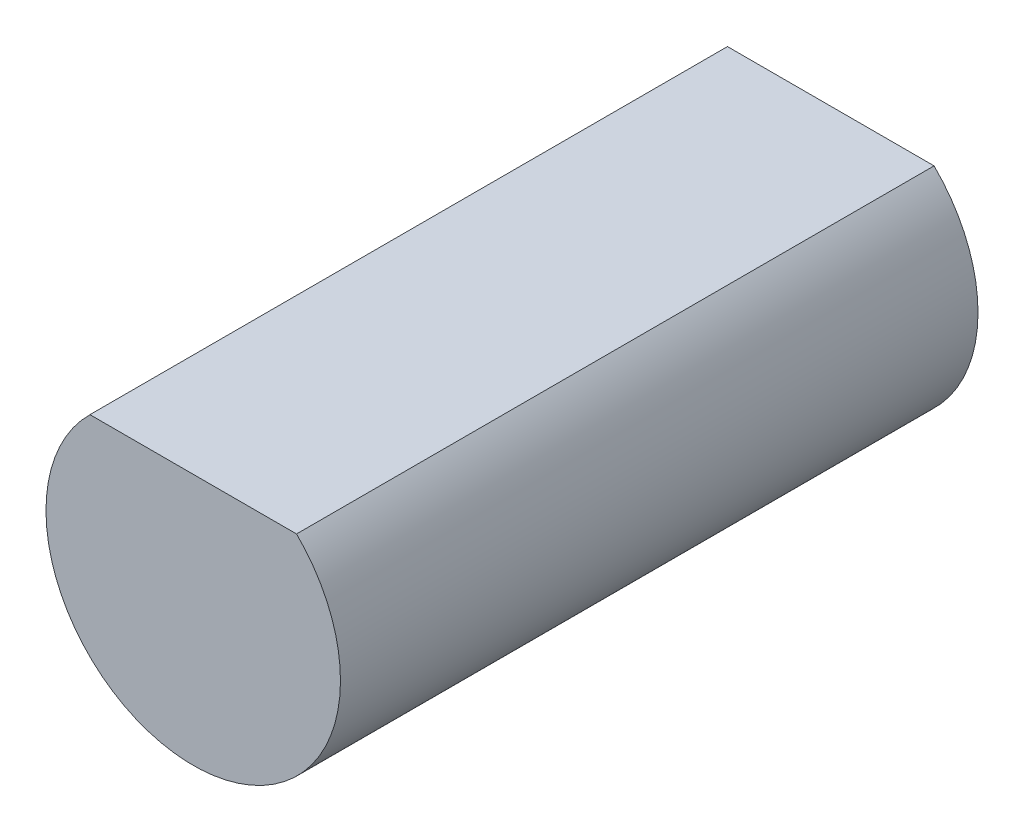
ISO-10303-21;
HEADER;
FILE_DESCRIPTION(('STEP AP214'),'2;1');
FILE_NAME('part.step','',(''),(''),'','','');
FILE_SCHEMA(('AUTOMOTIVE_DESIGN { 1 0 10303 214 1 1 1 1 }'));
ENDSEC;
DATA;
#1=APPLICATION_CONTEXT('core data for automotive mechanical design processes');
#2=APPLICATION_PROTOCOL_DEFINITION('international standard','automotive_design',2000,#1);
#3=PRODUCT_CONTEXT('',#1,'mechanical');
#4=PRODUCT('Part','Part','',(#3));
#5=PRODUCT_RELATED_PRODUCT_CATEGORY('part','',(#4));
#6=PRODUCT_DEFINITION_FORMATION('','',#4);
#7=PRODUCT_DEFINITION_CONTEXT('part definition',#1,'design');
#8=PRODUCT_DEFINITION('design','',#6,#7);
#9=PRODUCT_DEFINITION_SHAPE('','',#8);
#10=(LENGTH_UNIT() NAMED_UNIT(*) SI_UNIT(.MILLI.,.METRE.));
#11=(NAMED_UNIT(*) PLANE_ANGLE_UNIT() SI_UNIT($,.RADIAN.));
#12=(NAMED_UNIT(*) SI_UNIT($,.STERADIAN.) SOLID_ANGLE_UNIT());
#13=UNCERTAINTY_MEASURE_WITH_UNIT(LENGTH_MEASURE(1.E-05),#10,'distance_accuracy_value','');
#14=(GEOMETRIC_REPRESENTATION_CONTEXT(3) GLOBAL_UNCERTAINTY_ASSIGNED_CONTEXT((#13)) GLOBAL_UNIT_ASSIGNED_CONTEXT((#10,
#11,#12)) REPRESENTATION_CONTEXT('',''));
#15=CARTESIAN_POINT('',(0.,0.,0.));
#16=DIRECTION('',(0.,0.,1.));
#17=DIRECTION('',(1.,0.,0.));
#18=AXIS2_PLACEMENT_3D('',#15,#16,#17);
#19=CARTESIAN_POINT('',(0.,0.,17.32));
#20=DIRECTION('',(0.,0.,-1.));
#21=DIRECTION('',(-1.,0.,0.));
#22=AXIS2_PLACEMENT_3D('',#19,#20,#21);
#23=CYLINDRICAL_SURFACE('',#22,4.);
#24=CARTESIAN_POINT('',(0.,0.,0.));
#25=DIRECTION('',(0.,0.,1.));
#26=DIRECTION('',(1.,0.,0.));
#27=AXIS2_PLACEMENT_3D('',#24,#25,#26);
#28=CIRCLE('',#27,4.);
#29=CARTESIAN_POINT('',(-2.80668844013724,2.85,0.));
#30=VERTEX_POINT('',#29);
#31=CARTESIAN_POINT('',(2.80668844013724,2.85,0.));
#32=VERTEX_POINT('',#31);
#33=EDGE_CURVE('E74',#30,#32,#28,.T.);
#34=ORIENTED_EDGE('',*,*,#33,.T.);
#35=DIRECTION('',(0.,0.,-1.));
#36=VECTOR('',#35,1.);
#37=CARTESIAN_POINT('',(2.80668844013724,2.85,17.32));
#38=LINE('',#37,#36);
#39=CARTESIAN_POINT('',(2.80668844013724,2.85,17.32));
#40=VERTEX_POINT('',#39);
#41=EDGE_CURVE('E11',#40,#32,#38,.T.);
#42=ORIENTED_EDGE('',*,*,#41,.F.);
#43=CARTESIAN_POINT('',(0.,0.,17.32));
#44=DIRECTION('',(0.,0.,1.));
#45=DIRECTION('',(1.,0.,0.));
#46=AXIS2_PLACEMENT_3D('',#43,#44,#45);
#47=CIRCLE('',#46,4.);
#48=CARTESIAN_POINT('',(-2.80668844013724,2.85,17.32));
#49=VERTEX_POINT('',#48);
#50=EDGE_CURVE('E73',#49,#40,#47,.T.);
#51=ORIENTED_EDGE('',*,*,#50,.F.);
#52=DIRECTION('',(0.,0.,-1.));
#53=VECTOR('',#52,1.);
#54=CARTESIAN_POINT('',(-2.80668844013724,2.85,17.32));
#55=LINE('',#54,#53);
#56=EDGE_CURVE('E51',#49,#30,#55,.T.);
#57=ORIENTED_EDGE('',*,*,#56,.T.);
#58=EDGE_LOOP('',(#34,#42,#51,#57));
#59=FACE_BOUND('',#58,.T.);
#60=ADVANCED_FACE('F43',(#59),#23,.T.);
#61=CARTESIAN_POINT('',(-2.80668844013724,2.85,17.32));
#62=DIRECTION('',(0.,-1.,0.));
#63=DIRECTION('',(0.,0.,-1.));
#64=AXIS2_PLACEMENT_3D('',#61,#62,#63);
#65=PLANE('',#64);
#66=DIRECTION('',(-1.,0.,0.));
#67=VECTOR('',#66,1.);
#68=CARTESIAN_POINT('',(-2.80668844013724,2.85,0.));
#69=LINE('',#68,#67);
#70=EDGE_CURVE('E66',#32,#30,#69,.T.);
#71=ORIENTED_EDGE('',*,*,#70,.T.);
#72=ORIENTED_EDGE('',*,*,#56,.F.);
#73=DIRECTION('',(-1.,0.,0.));
#74=VECTOR('',#73,1.);
#75=CARTESIAN_POINT('',(-2.80668844013724,2.85,17.32));
#76=LINE('',#75,#74);
#77=EDGE_CURVE('E58',#40,#49,#76,.T.);
#78=ORIENTED_EDGE('',*,*,#77,.F.);
#79=ORIENTED_EDGE('',*,*,#41,.T.);
#80=EDGE_LOOP('',(#71,#72,#78,#79));
#81=FACE_BOUND('',#80,.T.);
#82=ADVANCED_FACE('F69',(#81),#65,.F.);
#83=CARTESIAN_POINT('',(0.,0.,17.32));
#84=DIRECTION('',(0.,0.,1.));
#85=DIRECTION('',(1.,0.,0.));
#86=AXIS2_PLACEMENT_3D('',#83,#84,#85);
#87=PLANE('',#86);
#88=ORIENTED_EDGE('',*,*,#50,.T.);
#89=ORIENTED_EDGE('',*,*,#77,.T.);
#90=EDGE_LOOP('',(#88,#89));
#91=FACE_BOUND('',#90,.T.);
#92=ADVANCED_FACE('F81',(#91),#87,.T.);
#93=CARTESIAN_POINT('',(0.,0.,0.));
#94=DIRECTION('',(0.,0.,1.));
#95=DIRECTION('',(1.,0.,0.));
#96=AXIS2_PLACEMENT_3D('',#93,#94,#95);
#97=PLANE('',#96);
#98=ORIENTED_EDGE('',*,*,#33,.F.);
#99=ORIENTED_EDGE('',*,*,#70,.F.);
#100=EDGE_LOOP('',(#98,#99));
#101=FACE_BOUND('',#100,.T.);
#102=ADVANCED_FACE('F77',(#101),#97,.F.);
#103=CLOSED_SHELL('',(#60,#82,#92,#102));
#104=MANIFOLD_SOLID_BREP('B2',#103);
#105=ADVANCED_BREP_SHAPE_REPRESENTATION('',(#18,#104),#14);
#106=SHAPE_DEFINITION_REPRESENTATION(#9,#105);
ENDSEC;
END-ISO-10303-21;
